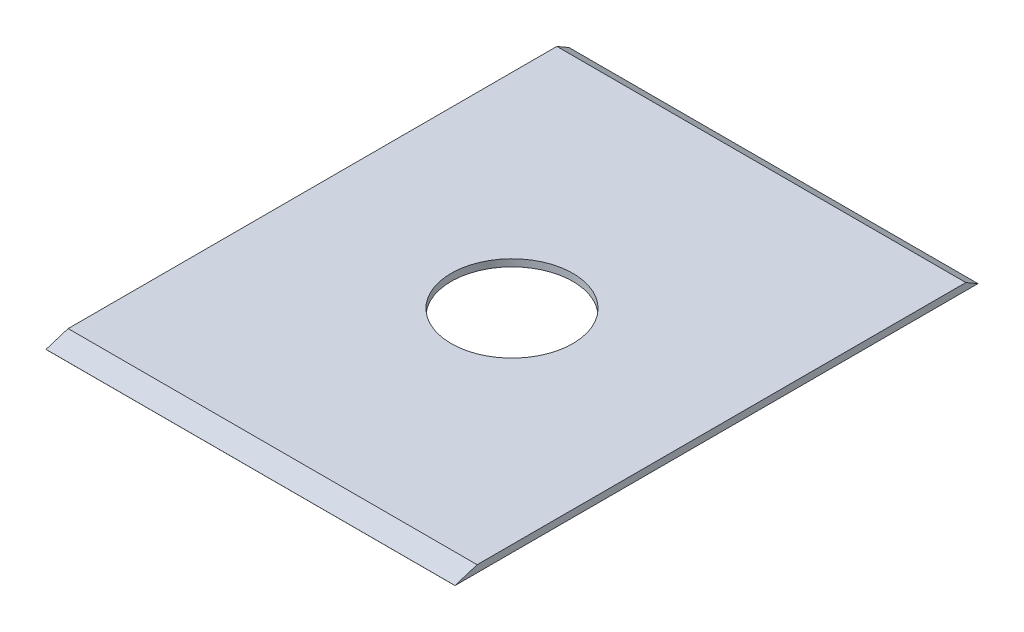
ISO-10303-21;
HEADER;
FILE_DESCRIPTION(('STEP AP214'),'2;1');
FILE_NAME('part.step','',(''),(''),'','','');
FILE_SCHEMA(('AUTOMOTIVE_DESIGN { 1 0 10303 214 1 1 1 1 }'));
ENDSEC;
DATA;
#1=APPLICATION_CONTEXT('core data for automotive mechanical design processes');
#2=APPLICATION_PROTOCOL_DEFINITION('international standard','automotive_design',2000,#1);
#3=PRODUCT_CONTEXT('',#1,'mechanical');
#4=PRODUCT('Part','Part','',(#3));
#5=PRODUCT_RELATED_PRODUCT_CATEGORY('part','',(#4));
#6=PRODUCT_DEFINITION_FORMATION('','',#4);
#7=PRODUCT_DEFINITION_CONTEXT('part definition',#1,'design');
#8=PRODUCT_DEFINITION('design','',#6,#7);
#9=PRODUCT_DEFINITION_SHAPE('','',#8);
#10=(LENGTH_UNIT() NAMED_UNIT(*) SI_UNIT(.MILLI.,.METRE.));
#11=(NAMED_UNIT(*) PLANE_ANGLE_UNIT() SI_UNIT($,.RADIAN.));
#12=(NAMED_UNIT(*) SI_UNIT($,.STERADIAN.) SOLID_ANGLE_UNIT());
#13=UNCERTAINTY_MEASURE_WITH_UNIT(LENGTH_MEASURE(1.E-05),#10,'distance_accuracy_value','');
#14=(GEOMETRIC_REPRESENTATION_CONTEXT(3) GLOBAL_UNCERTAINTY_ASSIGNED_CONTEXT((#13)) GLOBAL_UNIT_ASSIGNED_CONTEXT((#10,
#11,#12)) REPRESENTATION_CONTEXT('',''));
#15=CARTESIAN_POINT('',(0.,0.,0.));
#16=DIRECTION('',(0.,0.,1.));
#17=DIRECTION('',(1.,0.,0.));
#18=AXIS2_PLACEMENT_3D('',#15,#16,#17);
#19=CARTESIAN_POINT('',(0.,3.,0.));
#20=DIRECTION('',(0.,-1.,0.));
#21=DIRECTION('',(0.,0.,-1.));
#22=AXIS2_PLACEMENT_3D('',#19,#20,#21);
#23=PLANE('',#22);
#24=CARTESIAN_POINT('',(0.,3.,0.));
#25=DIRECTION('',(0.,1.,0.));
#26=DIRECTION('',(0.,0.,1.));
#27=AXIS2_PLACEMENT_3D('',#24,#25,#26);
#28=CIRCLE('',#27,26.);
#29=CARTESIAN_POINT('',(0.,3.,26.));
#30=VERTEX_POINT('',#29);
#31=EDGE_CURVE('E112',#30,#30,#28,.T.);
#32=ORIENTED_EDGE('',*,*,#31,.F.);
#33=EDGE_LOOP('',(#32));
#34=FACE_BOUND('',#33,.T.);
#35=DIRECTION('',(0.,0.,-1.));
#36=VECTOR('',#35,1.);
#37=CARTESIAN_POINT('',(87.34,3.,111.685));
#38=LINE('',#37,#36);
#39=CARTESIAN_POINT('',(87.34,3.,102.233000386306));
#40=VERTEX_POINT('',#39);
#41=CARTESIAN_POINT('',(87.34,3.,-106.491722689076));
#42=VERTEX_POINT('',#41);
#43=EDGE_CURVE('E99',#40,#42,#38,.T.);
#44=ORIENTED_EDGE('',*,*,#43,.T.);
#45=DIRECTION('',(-1.,0.,0.));
#46=VECTOR('',#45,1.);
#47=CARTESIAN_POINT('',(102.66,3.,-106.491722689076));
#48=LINE('',#47,#46);
#49=CARTESIAN_POINT('',(-87.34,3.,-106.491722689076));
#50=VERTEX_POINT('',#49);
#51=EDGE_CURVE('E83',#42,#50,#48,.T.);
#52=ORIENTED_EDGE('',*,*,#51,.T.);
#53=DIRECTION('',(0.,0.,1.));
#54=VECTOR('',#53,1.);
#55=CARTESIAN_POINT('',(-87.34,3.,111.685));
#56=LINE('',#55,#54);
#57=CARTESIAN_POINT('',(-87.34,3.,102.233000386306));
#58=VERTEX_POINT('',#57);
#59=EDGE_CURVE('E97',#50,#58,#56,.T.);
#60=ORIENTED_EDGE('',*,*,#59,.T.);
#61=DIRECTION('',(-1.,0.,0.));
#62=VECTOR('',#61,1.);
#63=CARTESIAN_POINT('',(102.66,3.,102.233000386306));
#64=LINE('',#63,#62);
#65=EDGE_CURVE('E91',#40,#58,#64,.T.);
#66=ORIENTED_EDGE('',*,*,#65,.F.);
#67=EDGE_LOOP('',(#44,#52,#60,#66));
#68=FACE_BOUND('',#67,.T.);
#69=ADVANCED_FACE('F33',(#34,#68),#23,.F.);
#70=CARTESIAN_POINT('',(87.34,3.,111.685));
#71=DIRECTION('',(-1.,0.,0.));
#72=DIRECTION('',(0.,0.,1.));
#73=AXIS2_PLACEMENT_3D('',#70,#71,#72);
#74=PLANE('',#73);
#75=DIRECTION('',(0.,0.,-1.));
#76=VECTOR('',#75,1.);
#77=CARTESIAN_POINT('',(87.34,0.,111.685));
#78=LINE('',#77,#76);
#79=CARTESIAN_POINT('',(87.34,0.,111.685));
#80=VERTEX_POINT('',#79);
#81=CARTESIAN_POINT('',(87.34,0.,-111.685));
#82=VERTEX_POINT('',#81);
#83=EDGE_CURVE('E110',#80,#82,#78,.T.);
#84=ORIENTED_EDGE('',*,*,#83,.T.);
#85=DIRECTION('',(0.,0.500207565093844,0.865905532851527));
#86=VECTOR('',#85,1.);
#87=CARTESIAN_POINT('',(87.34,97.4994289449972,57.0955240560453));
#88=LINE('',#87,#86);
#89=EDGE_CURVE('E123',#82,#42,#88,.T.);
#90=ORIENTED_EDGE('',*,*,#89,.T.);
#91=ORIENTED_EDGE('',*,*,#43,.F.);
#92=DIRECTION('',(0.,0.299930500954113,-0.953961055073746));
#93=VECTOR('',#92,1.);
#94=CARTESIAN_POINT('',(87.34,0.295574804532903,110.834714132086));
#95=LINE('',#94,#93);
#96=CARTESIAN_POINT('',(87.34,0.0282403415994171,111.685));
#97=VERTEX_POINT('',#96);
#98=EDGE_CURVE('E100',#97,#40,#95,.T.);
#99=ORIENTED_EDGE('',*,*,#98,.F.);
#100=DIRECTION('',(0.,-1.,0.));
#101=VECTOR('',#100,1.);
#102=CARTESIAN_POINT('',(87.34,3.,111.685));
#103=LINE('',#102,#101);
#104=EDGE_CURVE('E55',#97,#80,#103,.T.);
#105=ORIENTED_EDGE('',*,*,#104,.T.);
#106=EDGE_LOOP('',(#84,#90,#91,#99,#105));
#107=FACE_BOUND('',#106,.T.);
#108=ADVANCED_FACE('F35',(#107),#74,.F.);
#109=CARTESIAN_POINT('',(-87.34,3.,111.685));
#110=DIRECTION('',(1.,0.,0.));
#111=DIRECTION('',(0.,0.,-1.));
#112=AXIS2_PLACEMENT_3D('',#109,#110,#111);
#113=PLANE('',#112);
#114=ORIENTED_EDGE('',*,*,#59,.F.);
#115=DIRECTION('',(0.,0.500207565093844,0.865905532851528));
#116=VECTOR('',#115,1.);
#117=CARTESIAN_POINT('',(-87.34,48.3744030602329,-27.9444367192608));
#118=LINE('',#117,#116);
#119=CARTESIAN_POINT('',(-87.34,0.,-111.685));
#120=VERTEX_POINT('',#119);
#121=EDGE_CURVE('E80',#120,#50,#118,.T.);
#122=ORIENTED_EDGE('',*,*,#121,.F.);
#123=DIRECTION('',(0.,0.,1.));
#124=VECTOR('',#123,1.);
#125=CARTESIAN_POINT('',(-87.34,0.,111.685));
#126=LINE('',#125,#124);
#127=CARTESIAN_POINT('',(-87.34,0.,111.685));
#128=VERTEX_POINT('',#127);
#129=EDGE_CURVE('E114',#120,#128,#126,.T.);
#130=ORIENTED_EDGE('',*,*,#129,.T.);
#131=DIRECTION('',(0.,-1.,0.));
#132=VECTOR('',#131,1.);
#133=CARTESIAN_POINT('',(-87.34,3.,111.685));
#134=LINE('',#133,#132);
#135=CARTESIAN_POINT('',(-87.34,0.0282403415994173,111.685));
#136=VERTEX_POINT('',#135);
#137=EDGE_CURVE('E41',#136,#128,#134,.T.);
#138=ORIENTED_EDGE('',*,*,#137,.F.);
#139=DIRECTION('',(0.,0.299930500954113,-0.953961055073746));
#140=VECTOR('',#139,1.);
#141=CARTESIAN_POINT('',(-87.34,31.9812373724924,10.0550735223908));
#142=LINE('',#141,#140);
#143=EDGE_CURVE('E47',#136,#58,#142,.T.);
#144=ORIENTED_EDGE('',*,*,#143,.T.);
#145=EDGE_LOOP('',(#114,#122,#130,#138,#144));
#146=FACE_BOUND('',#145,.T.);
#147=ADVANCED_FACE('F102',(#146),#113,.F.);
#148=CARTESIAN_POINT('',(-87.34,3.,111.685));
#149=DIRECTION('',(0.,0.,-1.));
#150=DIRECTION('',(-1.,0.,0.));
#151=AXIS2_PLACEMENT_3D('',#148,#149,#150);
#152=PLANE('',#151);
#153=DIRECTION('',(1.,0.,0.));
#154=VECTOR('',#153,1.);
#155=CARTESIAN_POINT('',(-87.34,0.0282403415994216,111.685));
#156=LINE('',#155,#154);
#157=EDGE_CURVE('E11',#136,#97,#156,.T.);
#158=ORIENTED_EDGE('',*,*,#157,.F.);
#159=ORIENTED_EDGE('',*,*,#137,.T.);
#160=DIRECTION('',(1.,0.,0.));
#161=VECTOR('',#160,1.);
#162=CARTESIAN_POINT('',(-87.34,0.,111.685));
#163=LINE('',#162,#161);
#164=EDGE_CURVE('E106',#128,#80,#163,.T.);
#165=ORIENTED_EDGE('',*,*,#164,.T.);
#166=ORIENTED_EDGE('',*,*,#104,.F.);
#167=EDGE_LOOP('',(#158,#159,#165,#166));
#168=FACE_BOUND('',#167,.T.);
#169=ADVANCED_FACE('F117',(#168),#152,.F.);
#170=CARTESIAN_POINT('',(0.,0.,0.));
#171=DIRECTION('',(0.,-1.,0.));
#172=DIRECTION('',(0.,0.,-1.));
#173=AXIS2_PLACEMENT_3D('',#170,#171,#172);
#174=PLANE('',#173);
#175=ORIENTED_EDGE('',*,*,#83,.F.);
#176=ORIENTED_EDGE('',*,*,#164,.F.);
#177=ORIENTED_EDGE('',*,*,#129,.F.);
#178=DIRECTION('',(-1.,0.,0.));
#179=VECTOR('',#178,1.);
#180=CARTESIAN_POINT('',(-87.34,0.,-111.685));
#181=LINE('',#180,#179);
#182=EDGE_CURVE('E86',#82,#120,#181,.T.);
#183=ORIENTED_EDGE('',*,*,#182,.F.);
#184=EDGE_LOOP('',(#175,#176,#177,#183));
#185=FACE_BOUND('',#184,.T.);
#186=CARTESIAN_POINT('',(0.,0.,0.));
#187=DIRECTION('',(0.,1.,0.));
#188=DIRECTION('',(0.,0.,1.));
#189=AXIS2_PLACEMENT_3D('',#186,#187,#188);
#190=CIRCLE('',#189,26.);
#191=CARTESIAN_POINT('',(0.,0.,26.));
#192=VERTEX_POINT('',#191);
#193=EDGE_CURVE('E124',#192,#192,#190,.T.);
#194=ORIENTED_EDGE('',*,*,#193,.T.);
#195=EDGE_LOOP('',(#194));
#196=FACE_BOUND('',#195,.T.);
#197=ADVANCED_FACE('F121',(#185,#196),#174,.T.);
#198=CARTESIAN_POINT('',(0.,3.,0.));
#199=DIRECTION('',(0.,-1.,0.));
#200=DIRECTION('',(0.,0.,-1.));
#201=AXIS2_PLACEMENT_3D('',#198,#199,#200);
#202=CYLINDRICAL_SURFACE('',#201,26.);
#203=ORIENTED_EDGE('',*,*,#31,.T.);
#204=EDGE_LOOP('',(#203));
#205=FACE_BOUND('',#204,.T.);
#206=ORIENTED_EDGE('',*,*,#193,.F.);
#207=EDGE_LOOP('',(#206));
#208=FACE_BOUND('',#207,.T.);
#209=ADVANCED_FACE('F133',(#205,#208),#202,.F.);
#210=CARTESIAN_POINT('',(102.66,31.9812373724924,10.0550735223908));
#211=DIRECTION('',(0.,0.953961055073746,0.299930500954113));
#212=DIRECTION('',(0.,-0.299930500954113,0.953961055073746));
#213=AXIS2_PLACEMENT_3D('',#210,#211,#212);
#214=PLANE('',#213);
#215=ORIENTED_EDGE('',*,*,#98,.T.);
#216=ORIENTED_EDGE('',*,*,#65,.T.);
#217=ORIENTED_EDGE('',*,*,#143,.F.);
#218=ORIENTED_EDGE('',*,*,#157,.T.);
#219=EDGE_LOOP('',(#215,#216,#217,#218));
#220=FACE_BOUND('',#219,.T.);
#221=ADVANCED_FACE('F168',(#220),#214,.T.);
#222=CARTESIAN_POINT('',(102.66,48.3744030602329,-27.9444367192608));
#223=DIRECTION('',(0.,-0.865905532851527,0.500207565093844));
#224=DIRECTION('',(0.,-0.500207565093844,-0.865905532851527));
#225=AXIS2_PLACEMENT_3D('',#222,#223,#224);
#226=PLANE('',#225);
#227=ORIENTED_EDGE('',*,*,#182,.T.);
#228=ORIENTED_EDGE('',*,*,#121,.T.);
#229=ORIENTED_EDGE('',*,*,#51,.F.);
#230=ORIENTED_EDGE('',*,*,#89,.F.);
#231=EDGE_LOOP('',(#227,#228,#229,#230));
#232=FACE_BOUND('',#231,.T.);
#233=ADVANCED_FACE('F82',(#232),#226,.F.);
#234=CLOSED_SHELL('',(#69,#108,#147,#169,#197,#209,#221,#233));
#235=MANIFOLD_SOLID_BREP('B2',#234);
#236=ADVANCED_BREP_SHAPE_REPRESENTATION('',(#18,#235),#14);
#237=SHAPE_DEFINITION_REPRESENTATION(#9,#236);
ENDSEC;
END-ISO-10303-21;
